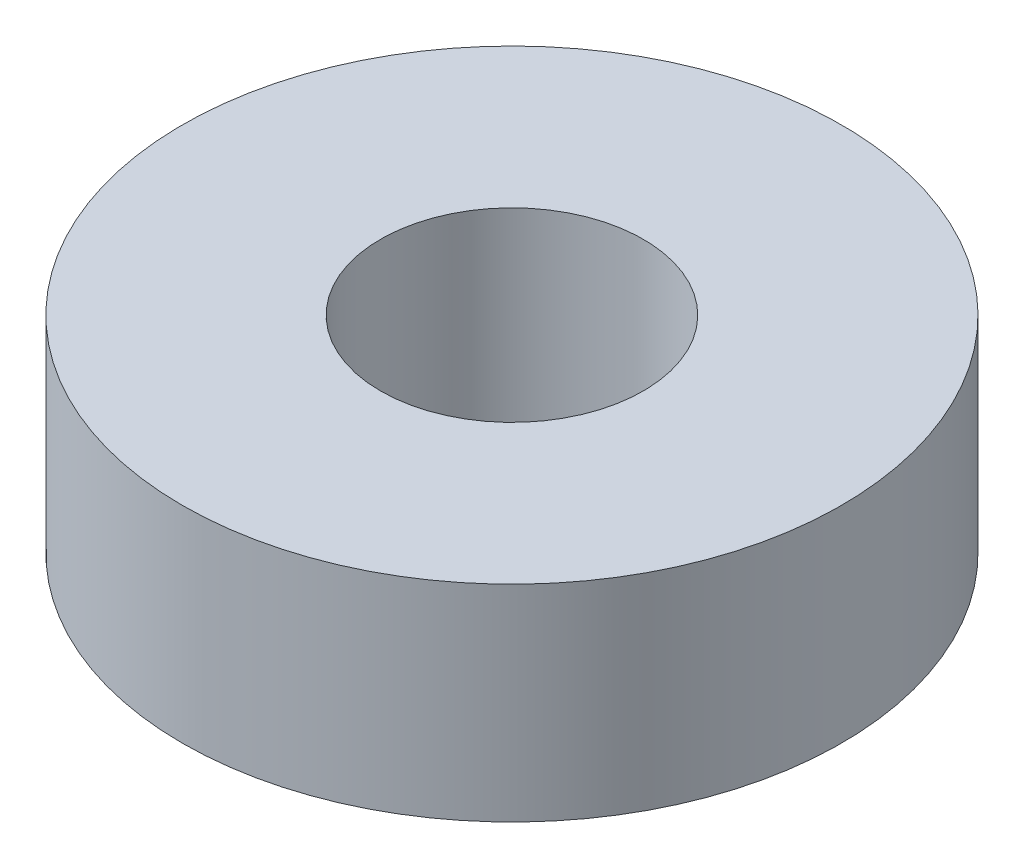
ISO-10303-21;
HEADER;
FILE_DESCRIPTION(('STEP AP214'),'2;1');
FILE_NAME('part.step','',(''),(''),'','','');
FILE_SCHEMA(('AUTOMOTIVE_DESIGN { 1 0 10303 214 1 1 1 1 }'));
ENDSEC;
DATA;
#1=APPLICATION_CONTEXT('core data for automotive mechanical design processes');
#2=APPLICATION_PROTOCOL_DEFINITION('international standard','automotive_design',2000,#1);
#3=PRODUCT_CONTEXT('',#1,'mechanical');
#4=PRODUCT('Part','Part','',(#3));
#5=PRODUCT_RELATED_PRODUCT_CATEGORY('part','',(#4));
#6=PRODUCT_DEFINITION_FORMATION('','',#4);
#7=PRODUCT_DEFINITION_CONTEXT('part definition',#1,'design');
#8=PRODUCT_DEFINITION('design','',#6,#7);
#9=PRODUCT_DEFINITION_SHAPE('','',#8);
#10=(LENGTH_UNIT() NAMED_UNIT(*) SI_UNIT(.MILLI.,.METRE.));
#11=(NAMED_UNIT(*) PLANE_ANGLE_UNIT() SI_UNIT($,.RADIAN.));
#12=(NAMED_UNIT(*) SI_UNIT($,.STERADIAN.) SOLID_ANGLE_UNIT());
#13=UNCERTAINTY_MEASURE_WITH_UNIT(LENGTH_MEASURE(1.E-05),#10,'distance_accuracy_value','');
#14=(GEOMETRIC_REPRESENTATION_CONTEXT(3) GLOBAL_UNCERTAINTY_ASSIGNED_CONTEXT((#13)) GLOBAL_UNIT_ASSIGNED_CONTEXT((#10,
#11,#12)) REPRESENTATION_CONTEXT('',''));
#15=CARTESIAN_POINT('',(0.,0.,0.));
#16=DIRECTION('',(0.,0.,1.));
#17=DIRECTION('',(1.,0.,0.));
#18=AXIS2_PLACEMENT_3D('',#15,#16,#17);
#19=CARTESIAN_POINT('',(0.,5.,0.));
#20=DIRECTION('',(0.,-1.,0.));
#21=DIRECTION('',(0.,0.,-1.));
#22=AXIS2_PLACEMENT_3D('',#19,#20,#21);
#23=CYLINDRICAL_SURFACE('',#22,8.);
#24=CARTESIAN_POINT('',(0.,5.,0.));
#25=DIRECTION('',(0.,1.,0.));
#26=DIRECTION('',(0.,0.,1.));
#27=AXIS2_PLACEMENT_3D('',#24,#25,#26);
#28=CIRCLE('',#27,8.);
#29=CARTESIAN_POINT('',(0.,5.,8.));
#30=VERTEX_POINT('',#29);
#31=EDGE_CURVE('E10',#30,#30,#28,.T.);
#32=ORIENTED_EDGE('',*,*,#31,.F.);
#33=EDGE_LOOP('',(#32));
#34=FACE_BOUND('',#33,.T.);
#35=CARTESIAN_POINT('',(0.,0.,0.));
#36=DIRECTION('',(0.,1.,0.));
#37=DIRECTION('',(0.,0.,1.));
#38=AXIS2_PLACEMENT_3D('',#35,#36,#37);
#39=CIRCLE('',#38,8.);
#40=CARTESIAN_POINT('',(0.,0.,8.));
#41=VERTEX_POINT('',#40);
#42=EDGE_CURVE('E36',#41,#41,#39,.T.);
#43=ORIENTED_EDGE('',*,*,#42,.T.);
#44=EDGE_LOOP('',(#43));
#45=FACE_BOUND('',#44,.T.);
#46=ADVANCED_FACE('F33',(#34,#45),#23,.T.);
#47=CARTESIAN_POINT('',(0.,5.,0.));
#48=DIRECTION('',(0.,1.,0.));
#49=DIRECTION('',(0.,0.,1.));
#50=AXIS2_PLACEMENT_3D('',#47,#48,#49);
#51=PLANE('',#50);
#52=CARTESIAN_POINT('',(0.,5.,0.));
#53=DIRECTION('',(0.,1.,0.));
#54=DIRECTION('',(0.,0.,1.));
#55=AXIS2_PLACEMENT_3D('',#52,#53,#54);
#56=CIRCLE('',#55,3.19);
#57=CARTESIAN_POINT('',(0.,5.,3.19));
#58=VERTEX_POINT('',#57);
#59=EDGE_CURVE('E43',#58,#58,#56,.T.);
#60=ORIENTED_EDGE('',*,*,#59,.F.);
#61=EDGE_LOOP('',(#60));
#62=FACE_BOUND('',#61,.T.);
#63=ORIENTED_EDGE('',*,*,#31,.T.);
#64=EDGE_LOOP('',(#63));
#65=FACE_BOUND('',#64,.T.);
#66=ADVANCED_FACE('F54',(#62,#65),#51,.T.);
#67=CARTESIAN_POINT('',(0.,0.,0.));
#68=DIRECTION('',(0.,1.,0.));
#69=DIRECTION('',(0.,0.,1.));
#70=AXIS2_PLACEMENT_3D('',#67,#68,#69);
#71=PLANE('',#70);
#72=CARTESIAN_POINT('',(0.,0.,0.));
#73=DIRECTION('',(0.,1.,0.));
#74=DIRECTION('',(0.,0.,1.));
#75=AXIS2_PLACEMENT_3D('',#72,#73,#74);
#76=CIRCLE('',#75,3.19);
#77=CARTESIAN_POINT('',(0.,0.,3.19));
#78=VERTEX_POINT('',#77);
#79=EDGE_CURVE('E45',#78,#78,#76,.T.);
#80=ORIENTED_EDGE('',*,*,#79,.T.);
#81=EDGE_LOOP('',(#80));
#82=FACE_BOUND('',#81,.T.);
#83=ORIENTED_EDGE('',*,*,#42,.F.);
#84=EDGE_LOOP('',(#83));
#85=FACE_BOUND('',#84,.T.);
#86=ADVANCED_FACE('F56',(#82,#85),#71,.F.);
#87=CARTESIAN_POINT('',(0.,5.,0.));
#88=DIRECTION('',(0.,-1.,0.));
#89=DIRECTION('',(0.,0.,-1.));
#90=AXIS2_PLACEMENT_3D('',#87,#88,#89);
#91=CYLINDRICAL_SURFACE('',#90,3.19);
#92=ORIENTED_EDGE('',*,*,#59,.T.);
#93=EDGE_LOOP('',(#92));
#94=FACE_BOUND('',#93,.T.);
#95=ORIENTED_EDGE('',*,*,#79,.F.);
#96=EDGE_LOOP('',(#95));
#97=FACE_BOUND('',#96,.T.);
#98=ADVANCED_FACE('F51',(#94,#97),#91,.F.);
#99=CLOSED_SHELL('',(#46,#66,#86,#98));
#100=MANIFOLD_SOLID_BREP('B2',#99);
#101=ADVANCED_BREP_SHAPE_REPRESENTATION('',(#18,#100),#14);
#102=SHAPE_DEFINITION_REPRESENTATION(#9,#101);
ENDSEC;
END-ISO-10303-21;
